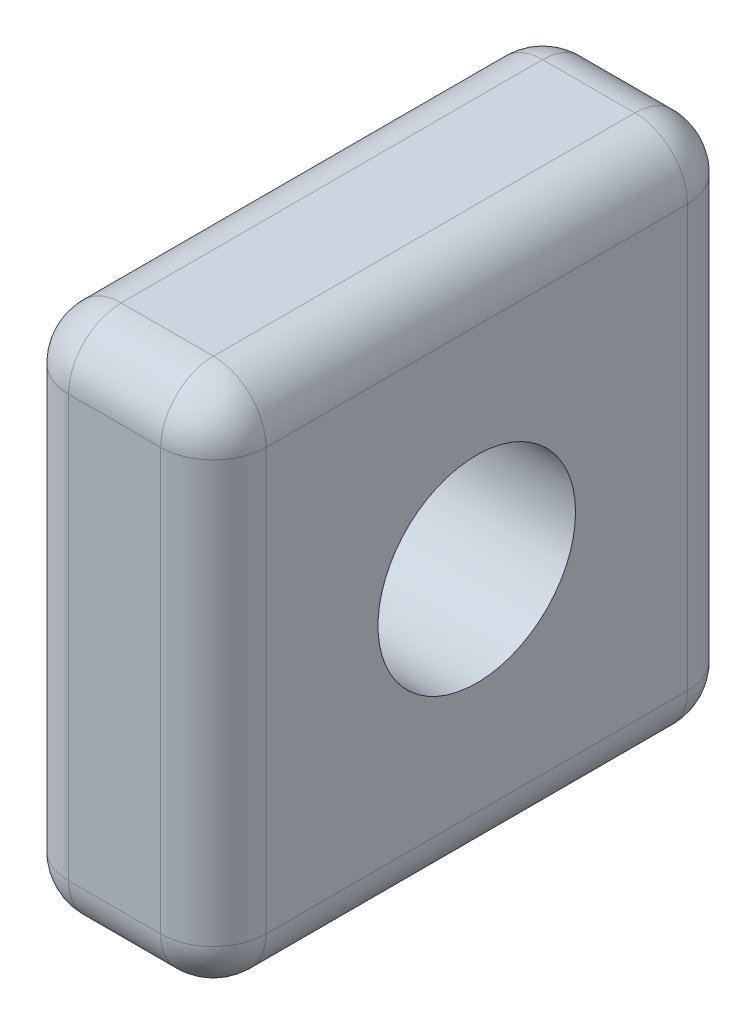
ISO-10303-21;
HEADER;
FILE_DESCRIPTION(('STEP AP214'),'2;1');
FILE_NAME('part.step','',(''),(''),'','','');
FILE_SCHEMA(('AUTOMOTIVE_DESIGN { 1 0 10303 214 1 1 1 1 }'));
ENDSEC;
DATA;
#1=APPLICATION_CONTEXT('core data for automotive mechanical design processes');
#2=APPLICATION_PROTOCOL_DEFINITION('international standard','automotive_design',2000,#1);
#3=PRODUCT_CONTEXT('',#1,'mechanical');
#4=PRODUCT('Part','Part','',(#3));
#5=PRODUCT_RELATED_PRODUCT_CATEGORY('part','',(#4));
#6=PRODUCT_DEFINITION_FORMATION('','',#4);
#7=PRODUCT_DEFINITION_CONTEXT('part definition',#1,'design');
#8=PRODUCT_DEFINITION('design','',#6,#7);
#9=PRODUCT_DEFINITION_SHAPE('','',#8);
#10=(LENGTH_UNIT() NAMED_UNIT(*) SI_UNIT(.MILLI.,.METRE.));
#11=(NAMED_UNIT(*) PLANE_ANGLE_UNIT() SI_UNIT($,.RADIAN.));
#12=(NAMED_UNIT(*) SI_UNIT($,.STERADIAN.) SOLID_ANGLE_UNIT());
#13=UNCERTAINTY_MEASURE_WITH_UNIT(LENGTH_MEASURE(1.E-05),#10,'distance_accuracy_value','');
#14=(GEOMETRIC_REPRESENTATION_CONTEXT(3) GLOBAL_UNCERTAINTY_ASSIGNED_CONTEXT((#13)) GLOBAL_UNIT_ASSIGNED_CONTEXT((#10,
#11,#12)) REPRESENTATION_CONTEXT('',''));
#15=CARTESIAN_POINT('',(0.,0.,0.));
#16=DIRECTION('',(0.,0.,1.));
#17=DIRECTION('',(1.,0.,0.));
#18=AXIS2_PLACEMENT_3D('',#15,#16,#17);
#19=CARTESIAN_POINT('',(4.7625,0.,0.));
#20=DIRECTION('',(0.,0.,-1.));
#21=DIRECTION('',(-1.,0.,0.));
#22=AXIS2_PLACEMENT_3D('',#19,#20,#21);
#23=PLANE('',#22);
#24=DIRECTION('',(0.,-1.,0.));
#25=VECTOR('',#24,1.);
#26=CARTESIAN_POINT('',(1.27,0.,0.));
#27=LINE('',#26,#25);
#28=CARTESIAN_POINT('',(1.27,11.43,0.));
#29=VERTEX_POINT('',#28);
#30=CARTESIAN_POINT('',(1.27,1.27,0.));
#31=VERTEX_POINT('',#30);
#32=EDGE_CURVE('E211',#29,#31,#27,.T.);
#33=ORIENTED_EDGE('',*,*,#32,.T.);
#34=DIRECTION('',(-1.,0.,0.));
#35=VECTOR('',#34,1.);
#36=CARTESIAN_POINT('',(4.7625,1.27,0.));
#37=LINE('',#36,#35);
#38=CARTESIAN_POINT('',(3.4925,1.27,0.));
#39=VERTEX_POINT('',#38);
#40=EDGE_CURVE('E214',#31,#39,#37,.F.);
#41=ORIENTED_EDGE('',*,*,#40,.T.);
#42=DIRECTION('',(0.,-1.,0.));
#43=VECTOR('',#42,1.);
#44=CARTESIAN_POINT('',(3.4925,0.,0.));
#45=LINE('',#44,#43);
#46=CARTESIAN_POINT('',(3.4925,11.43,0.));
#47=VERTEX_POINT('',#46);
#48=EDGE_CURVE('E321',#39,#47,#45,.F.);
#49=ORIENTED_EDGE('',*,*,#48,.T.);
#50=DIRECTION('',(-1.,0.,0.));
#51=VECTOR('',#50,1.);
#52=CARTESIAN_POINT('',(4.7625,11.43,0.));
#53=LINE('',#52,#51);
#54=EDGE_CURVE('E208',#47,#29,#53,.T.);
#55=ORIENTED_EDGE('',*,*,#54,.T.);
#56=EDGE_LOOP('',(#33,#41,#49,#55));
#57=FACE_BOUND('',#56,.T.);
#58=ADVANCED_FACE('F46',(#57),#23,.F.);
#59=CARTESIAN_POINT('',(4.7625,0.,0.));
#60=DIRECTION('',(0.,1.,0.));
#61=DIRECTION('',(0.,0.,1.));
#62=AXIS2_PLACEMENT_3D('',#59,#60,#61);
#63=PLANE('',#62);
#64=DIRECTION('',(0.,0.,-1.));
#65=VECTOR('',#64,1.);
#66=CARTESIAN_POINT('',(3.4925,0.,0.));
#67=LINE('',#66,#65);
#68=CARTESIAN_POINT('',(3.4925,0.,-11.43));
#69=VERTEX_POINT('',#68);
#70=CARTESIAN_POINT('',(3.4925,0.,-1.27));
#71=VERTEX_POINT('',#70);
#72=EDGE_CURVE('E317',#69,#71,#67,.F.);
#73=ORIENTED_EDGE('',*,*,#72,.T.);
#74=DIRECTION('',(-1.,0.,0.));
#75=VECTOR('',#74,1.);
#76=CARTESIAN_POINT('',(4.7625,0.,-1.27));
#77=LINE('',#76,#75);
#78=CARTESIAN_POINT('',(1.27,0.,-1.27));
#79=VERTEX_POINT('',#78);
#80=EDGE_CURVE('E223',#71,#79,#77,.T.);
#81=ORIENTED_EDGE('',*,*,#80,.T.);
#82=DIRECTION('',(0.,0.,-1.));
#83=VECTOR('',#82,1.);
#84=CARTESIAN_POINT('',(1.27,0.,-12.7));
#85=LINE('',#84,#83);
#86=CARTESIAN_POINT('',(1.27,0.,-11.43));
#87=VERTEX_POINT('',#86);
#88=EDGE_CURVE('E220',#79,#87,#85,.T.);
#89=ORIENTED_EDGE('',*,*,#88,.T.);
#90=DIRECTION('',(-1.,0.,0.));
#91=VECTOR('',#90,1.);
#92=CARTESIAN_POINT('',(4.7625,0.,-11.43));
#93=LINE('',#92,#91);
#94=EDGE_CURVE('E217',#87,#69,#93,.F.);
#95=ORIENTED_EDGE('',*,*,#94,.T.);
#96=EDGE_LOOP('',(#73,#81,#89,#95));
#97=FACE_BOUND('',#96,.T.);
#98=ADVANCED_FACE('F400',(#97),#63,.F.);
#99=CARTESIAN_POINT('',(4.7625,0.,-12.7));
#100=DIRECTION('',(0.,0.,1.));
#101=DIRECTION('',(1.,0.,0.));
#102=AXIS2_PLACEMENT_3D('',#99,#100,#101);
#103=PLANE('',#102);
#104=DIRECTION('',(0.,1.,0.));
#105=VECTOR('',#104,1.);
#106=CARTESIAN_POINT('',(3.4925,0.,-12.7));
#107=LINE('',#106,#105);
#108=CARTESIAN_POINT('',(3.4925,11.43,-12.7));
#109=VERTEX_POINT('',#108);
#110=CARTESIAN_POINT('',(3.4925,1.27,-12.7));
#111=VERTEX_POINT('',#110);
#112=EDGE_CURVE('E141',#109,#111,#107,.F.);
#113=ORIENTED_EDGE('',*,*,#112,.T.);
#114=DIRECTION('',(-1.,0.,0.));
#115=VECTOR('',#114,1.);
#116=CARTESIAN_POINT('',(4.7625,1.27,-12.7));
#117=LINE('',#116,#115);
#118=CARTESIAN_POINT('',(1.27,1.27,-12.7));
#119=VERTEX_POINT('',#118);
#120=EDGE_CURVE('E11',#111,#119,#117,.T.);
#121=ORIENTED_EDGE('',*,*,#120,.T.);
#122=DIRECTION('',(0.,1.,0.));
#123=VECTOR('',#122,1.);
#124=CARTESIAN_POINT('',(1.27,12.7,-12.7));
#125=LINE('',#124,#123);
#126=CARTESIAN_POINT('',(1.27,11.43,-12.7));
#127=VERTEX_POINT('',#126);
#128=EDGE_CURVE('E56',#119,#127,#125,.T.);
#129=ORIENTED_EDGE('',*,*,#128,.T.);
#130=DIRECTION('',(-1.,0.,0.));
#131=VECTOR('',#130,1.);
#132=CARTESIAN_POINT('',(4.7625,11.43,-12.7));
#133=LINE('',#132,#131);
#134=EDGE_CURVE('E235',#127,#109,#133,.F.);
#135=ORIENTED_EDGE('',*,*,#134,.T.);
#136=EDGE_LOOP('',(#113,#121,#129,#135));
#137=FACE_BOUND('',#136,.T.);
#138=ADVANCED_FACE('F398',(#137),#103,.F.);
#139=CARTESIAN_POINT('',(4.7625,12.7,0.));
#140=DIRECTION('',(0.,-1.,0.));
#141=DIRECTION('',(0.,0.,-1.));
#142=AXIS2_PLACEMENT_3D('',#139,#140,#141);
#143=PLANE('',#142);
#144=DIRECTION('',(0.,0.,1.));
#145=VECTOR('',#144,1.);
#146=CARTESIAN_POINT('',(1.27,12.7,0.));
#147=LINE('',#146,#145);
#148=CARTESIAN_POINT('',(1.27,12.7,-11.43));
#149=VERTEX_POINT('',#148);
#150=CARTESIAN_POINT('',(1.27,12.7,-1.27));
#151=VERTEX_POINT('',#150);
#152=EDGE_CURVE('E229',#149,#151,#147,.T.);
#153=ORIENTED_EDGE('',*,*,#152,.T.);
#154=DIRECTION('',(-1.,0.,0.));
#155=VECTOR('',#154,1.);
#156=CARTESIAN_POINT('',(4.7625,12.7,-1.27));
#157=LINE('',#156,#155);
#158=CARTESIAN_POINT('',(3.4925,12.7,-1.27));
#159=VERTEX_POINT('',#158);
#160=EDGE_CURVE('E232',#151,#159,#157,.F.);
#161=ORIENTED_EDGE('',*,*,#160,.T.);
#162=DIRECTION('',(0.,0.,1.));
#163=VECTOR('',#162,1.);
#164=CARTESIAN_POINT('',(3.4925,12.7,0.));
#165=LINE('',#164,#163);
#166=CARTESIAN_POINT('',(3.4925,12.7,-11.43));
#167=VERTEX_POINT('',#166);
#168=EDGE_CURVE('E325',#159,#167,#165,.F.);
#169=ORIENTED_EDGE('',*,*,#168,.T.);
#170=DIRECTION('',(-1.,0.,0.));
#171=VECTOR('',#170,1.);
#172=CARTESIAN_POINT('',(4.7625,12.7,-11.43));
#173=LINE('',#172,#171);
#174=EDGE_CURVE('E226',#167,#149,#173,.T.);
#175=ORIENTED_EDGE('',*,*,#174,.T.);
#176=EDGE_LOOP('',(#153,#161,#169,#175));
#177=FACE_BOUND('',#176,.T.);
#178=ADVANCED_FACE('F396',(#177),#143,.F.);
#179=CARTESIAN_POINT('',(4.7625,0.,0.));
#180=DIRECTION('',(-1.,0.,0.));
#181=DIRECTION('',(0.,0.,1.));
#182=AXIS2_PLACEMENT_3D('',#179,#180,#181);
#183=PLANE('',#182);
#184=DIRECTION('',(0.,0.,-1.));
#185=VECTOR('',#184,1.);
#186=CARTESIAN_POINT('',(4.7625,1.27,0.));
#187=LINE('',#186,#185);
#188=CARTESIAN_POINT('',(4.7625,1.27,-1.27));
#189=VERTEX_POINT('',#188);
#190=CARTESIAN_POINT('',(4.7625,1.27,-11.43));
#191=VERTEX_POINT('',#190);
#192=EDGE_CURVE('E169',#189,#191,#187,.T.);
#193=ORIENTED_EDGE('',*,*,#192,.T.);
#194=DIRECTION('',(0.,1.,0.));
#195=VECTOR('',#194,1.);
#196=CARTESIAN_POINT('',(4.7625,0.,-11.43));
#197=LINE('',#196,#195);
#198=CARTESIAN_POINT('',(4.7625,11.43,-11.43));
#199=VERTEX_POINT('',#198);
#200=EDGE_CURVE('E139',#191,#199,#197,.T.);
#201=ORIENTED_EDGE('',*,*,#200,.T.);
#202=DIRECTION('',(0.,0.,1.));
#203=VECTOR('',#202,1.);
#204=CARTESIAN_POINT('',(4.7625,11.43,0.));
#205=LINE('',#204,#203);
#206=CARTESIAN_POINT('',(4.7625,11.43,-1.27));
#207=VERTEX_POINT('',#206);
#208=EDGE_CURVE('E152',#199,#207,#205,.T.);
#209=ORIENTED_EDGE('',*,*,#208,.T.);
#210=DIRECTION('',(0.,-1.,0.));
#211=VECTOR('',#210,1.);
#212=CARTESIAN_POINT('',(4.7625,0.,-1.27));
#213=LINE('',#212,#211);
#214=EDGE_CURVE('E162',#207,#189,#213,.T.);
#215=ORIENTED_EDGE('',*,*,#214,.T.);
#216=EDGE_LOOP('',(#193,#201,#209,#215));
#217=FACE_BOUND('',#216,.T.);
#218=CARTESIAN_POINT('',(4.7625,6.35,-6.35));
#219=DIRECTION('',(1.,0.,0.));
#220=DIRECTION('',(0.,0.,-1.));
#221=AXIS2_PLACEMENT_3D('',#218,#219,#220);
#222=CIRCLE('',#221,2.38125);
#223=CARTESIAN_POINT('',(4.7625,6.35,-8.73125));
#224=VERTEX_POINT('',#223);
#225=EDGE_CURVE('E163',#224,#224,#222,.T.);
#226=ORIENTED_EDGE('',*,*,#225,.F.);
#227=EDGE_LOOP('',(#226));
#228=FACE_BOUND('',#227,.T.);
#229=ADVANCED_FACE('F166',(#217,#228),#183,.F.);
#230=CARTESIAN_POINT('',(0.,0.,0.));
#231=DIRECTION('',(-1.,0.,0.));
#232=DIRECTION('',(0.,0.,1.));
#233=AXIS2_PLACEMENT_3D('',#230,#231,#232);
#234=PLANE('',#233);
#235=CARTESIAN_POINT('',(0.,6.35,-6.35));
#236=DIRECTION('',(-1.,0.,0.));
#237=DIRECTION('',(0.,0.,1.));
#238=AXIS2_PLACEMENT_3D('',#235,#236,#237);
#239=CIRCLE('',#238,3.65125);
#240=CARTESIAN_POINT('',(0.,6.35,-2.69875));
#241=VERTEX_POINT('',#240);
#242=EDGE_CURVE('E200',#241,#241,#239,.F.);
#243=ORIENTED_EDGE('',*,*,#242,.T.);
#244=EDGE_LOOP('',(#243));
#245=FACE_BOUND('',#244,.T.);
#246=DIRECTION('',(0.,0.,-1.));
#247=VECTOR('',#246,1.);
#248=CARTESIAN_POINT('',(0.,1.27,0.));
#249=LINE('',#248,#247);
#250=CARTESIAN_POINT('',(0.,1.27,-11.43));
#251=VERTEX_POINT('',#250);
#252=CARTESIAN_POINT('',(0.,1.27,-1.27));
#253=VERTEX_POINT('',#252);
#254=EDGE_CURVE('E193',#251,#253,#249,.F.);
#255=ORIENTED_EDGE('',*,*,#254,.T.);
#256=DIRECTION('',(0.,-1.,0.));
#257=VECTOR('',#256,1.);
#258=CARTESIAN_POINT('',(0.,12.7,-1.27));
#259=LINE('',#258,#257);
#260=CARTESIAN_POINT('',(0.,11.43,-1.27));
#261=VERTEX_POINT('',#260);
#262=EDGE_CURVE('E196',#253,#261,#259,.F.);
#263=ORIENTED_EDGE('',*,*,#262,.T.);
#264=DIRECTION('',(0.,0.,1.));
#265=VECTOR('',#264,1.);
#266=CARTESIAN_POINT('',(0.,11.43,-12.7));
#267=LINE('',#266,#265);
#268=CARTESIAN_POINT('',(0.,11.43,-11.43));
#269=VERTEX_POINT('',#268);
#270=EDGE_CURVE('E190',#261,#269,#267,.F.);
#271=ORIENTED_EDGE('',*,*,#270,.T.);
#272=DIRECTION('',(0.,1.,0.));
#273=VECTOR('',#272,1.);
#274=CARTESIAN_POINT('',(0.,0.,-11.43));
#275=LINE('',#274,#273);
#276=EDGE_CURVE('E187',#269,#251,#275,.F.);
#277=ORIENTED_EDGE('',*,*,#276,.T.);
#278=EDGE_LOOP('',(#255,#263,#271,#277));
#279=FACE_BOUND('',#278,.T.);
#280=ADVANCED_FACE('F633',(#245,#279),#234,.T.);
#281=CARTESIAN_POINT('',(0.,6.35,-6.35));
#282=DIRECTION('',(1.,0.,0.));
#283=DIRECTION('',(0.,0.,-1.));
#284=AXIS2_PLACEMENT_3D('',#281,#282,#283);
#285=CYLINDRICAL_SURFACE('',#284,2.38125);
#286=CARTESIAN_POINT('',(1.27,6.35,-6.35));
#287=DIRECTION('',(-1.,0.,0.));
#288=DIRECTION('',(0.,0.,1.));
#289=AXIS2_PLACEMENT_3D('',#286,#287,#288);
#290=CIRCLE('',#289,2.38125);
#291=CARTESIAN_POINT('',(1.27,6.35,-8.73125));
#292=VERTEX_POINT('',#291);
#293=EDGE_CURVE('E204',#292,#292,#290,.T.);
#294=CARTESIAN_POINT('',(1.27,6.35,-8.73125));
#295=CARTESIAN_POINT('',(1.30638020833333,6.35,-8.73125));
#296=CARTESIAN_POINT('',(1.34276041666667,6.35,-8.73125));
#297=CARTESIAN_POINT('',(1.41552083333333,6.35,-8.73125));
#298=CARTESIAN_POINT('',(1.45190104166667,6.35,-8.73125));
#299=CARTESIAN_POINT('',(1.52466145833333,6.35,-8.73125));
#300=CARTESIAN_POINT('',(1.56104166666667,6.35,-8.73125));
#301=CARTESIAN_POINT('',(1.63380208333333,6.35,-8.73125));
#302=CARTESIAN_POINT('',(1.67018229166667,6.35,-8.73125));
#303=CARTESIAN_POINT('',(1.74294270833333,6.35,-8.73125));
#304=CARTESIAN_POINT('',(1.77932291666667,6.35,-8.73125));
#305=CARTESIAN_POINT('',(1.85208333333333,6.35,-8.73125));
#306=CARTESIAN_POINT('',(1.88846354166667,6.35,-8.73125));
#307=CARTESIAN_POINT('',(1.96122395833333,6.35,-8.73125));
#308=CARTESIAN_POINT('',(1.99760416666667,6.35,-8.73125));
#309=CARTESIAN_POINT('',(2.07036458333333,6.35,-8.73125));
#310=CARTESIAN_POINT('',(2.10674479166667,6.35,-8.73125));
#311=CARTESIAN_POINT('',(2.17950520833333,6.35,-8.73125));
#312=CARTESIAN_POINT('',(2.21588541666667,6.35,-8.73125));
#313=CARTESIAN_POINT('',(2.28864583333333,6.35,-8.73125));
#314=CARTESIAN_POINT('',(2.32502604166667,6.35,-8.73125));
#315=CARTESIAN_POINT('',(2.39778645833333,6.35,-8.73125));
#316=CARTESIAN_POINT('',(2.43416666666667,6.35,-8.73125));
#317=CARTESIAN_POINT('',(2.50692708333333,6.35,-8.73125));
#318=CARTESIAN_POINT('',(2.54330729166667,6.35,-8.73125));
#319=CARTESIAN_POINT('',(2.61606770833333,6.35,-8.73125));
#320=CARTESIAN_POINT('',(2.65244791666667,6.35,-8.73125));
#321=CARTESIAN_POINT('',(2.72520833333333,6.35,-8.73125));
#322=CARTESIAN_POINT('',(2.76158854166667,6.35,-8.73125));
#323=CARTESIAN_POINT('',(2.83434895833333,6.35,-8.73125));
#324=CARTESIAN_POINT('',(2.87072916666667,6.35,-8.73125));
#325=CARTESIAN_POINT('',(2.94348958333333,6.35,-8.73125));
#326=CARTESIAN_POINT('',(2.97986979166667,6.35,-8.73125));
#327=CARTESIAN_POINT('',(3.05263020833333,6.35,-8.73125));
#328=CARTESIAN_POINT('',(3.08901041666667,6.35,-8.73125));
#329=CARTESIAN_POINT('',(3.16177083333333,6.35,-8.73125));
#330=CARTESIAN_POINT('',(3.19815104166667,6.35,-8.73125));
#331=CARTESIAN_POINT('',(3.27091145833333,6.35,-8.73125));
#332=CARTESIAN_POINT('',(3.30729166666667,6.35,-8.73125));
#333=CARTESIAN_POINT('',(3.38005208333333,6.35,-8.73125));
#334=CARTESIAN_POINT('',(3.41643229166667,6.35,-8.73125));
#335=CARTESIAN_POINT('',(3.48919270833333,6.35,-8.73125));
#336=CARTESIAN_POINT('',(3.52557291666667,6.35,-8.73125));
#337=CARTESIAN_POINT('',(3.59833333333333,6.35,-8.73125));
#338=CARTESIAN_POINT('',(3.63471354166667,6.35,-8.73125));
#339=CARTESIAN_POINT('',(3.70747395833333,6.35,-8.73125));
#340=CARTESIAN_POINT('',(3.74385416666667,6.35,-8.73125));
#341=CARTESIAN_POINT('',(3.81661458333333,6.35,-8.73125));
#342=CARTESIAN_POINT('',(3.85299479166667,6.35,-8.73125));
#343=CARTESIAN_POINT('',(3.92575520833333,6.35,-8.73125));
#344=CARTESIAN_POINT('',(3.96213541666667,6.35,-8.73125));
#345=CARTESIAN_POINT('',(4.03489583333333,6.35,-8.73125));
#346=CARTESIAN_POINT('',(4.07127604166667,6.35,-8.73125));
#347=CARTESIAN_POINT('',(4.14403645833333,6.35,-8.73125));
#348=CARTESIAN_POINT('',(4.18041666666667,6.35,-8.73125));
#349=CARTESIAN_POINT('',(4.25317708333333,6.35,-8.73125));
#350=CARTESIAN_POINT('',(4.28955729166667,6.35,-8.73125));
#351=CARTESIAN_POINT('',(4.36231770833333,6.35,-8.73125));
#352=CARTESIAN_POINT('',(4.39869791666667,6.35,-8.73125));
#353=CARTESIAN_POINT('',(4.47145833333333,6.35,-8.73125));
#354=CARTESIAN_POINT('',(4.50783854166667,6.35,-8.73125));
#355=CARTESIAN_POINT('',(4.58059895833333,6.35,-8.73125));
#356=CARTESIAN_POINT('',(4.61697916666667,6.35,-8.73125));
#357=CARTESIAN_POINT('',(4.68973958333333,6.35,-8.73125));
#358=CARTESIAN_POINT('',(4.72611979166667,6.35,-8.73125));
#359=CARTESIAN_POINT('',(4.7625,6.35,-8.73125));
#360=B_SPLINE_CURVE_WITH_KNOTS('',3,(#294,#295,#296,#297,#298,#299,#300,#301,#302,#303,#304,
#305,#306,#307,#308,#309,#310,#311,#312,#313,#314,#315,#316,#317,#318,#319,#320,#321,#322,#323,
#324,#325,#326,#327,#328,#329,#330,#331,#332,#333,#334,#335,#336,#337,#338,#339,#340,#341,#342,
#343,#344,#345,#346,#347,#348,#349,#350,#351,#352,#353,#354,#355,#356,#357,#358,#359),
.UNSPECIFIED.,.F.,.F.,(4,2,2,2,2,2,2,2,2,2,2,2,2,2,2,2,2,2,2,2,2,2,2,2,2,2,2,2,2,2,2,2,4),(0.,
0.109140625,0.21828125,0.327421875,0.4365625,0.545703125,0.65484375,0.763984375,0.873125,
0.982265625,1.09140625,1.200546875,1.3096875,1.418828125,1.52796875,1.637109375,1.74625,
1.855390625,1.96453125,2.073671875,2.1828125,2.291953125,2.40109375,2.510234375,2.619375,
2.728515625,2.83765625,2.946796875,3.0559375,3.165078125,3.27421875,3.383359375,3.4925),.UNSPECIFIED.);
#361=EDGE_CURVE('BSEAM422',#292,#224,#360,.T.);
#362=ORIENTED_EDGE('',*,*,#293,.T.);
#363=ORIENTED_EDGE('',*,*,#225,.T.);
#364=ORIENTED_EDGE('',*,*,#361,.T.);
#365=ORIENTED_EDGE('',*,*,#361,.F.);
#366=EDGE_LOOP('',(#362,#364,#363,#365));
#367=FACE_BOUND('',#366,.T.);
#368=ADVANCED_FACE('F422',(#367),#285,.F.);
#369=CARTESIAN_POINT('',(3.4925,0.,-1.27));
#370=DIRECTION('',(0.,-1.,0.));
#371=DIRECTION('',(0.,0.,-1.));
#372=AXIS2_PLACEMENT_3D('',#369,#370,#371);
#373=CYLINDRICAL_SURFACE('',#372,1.27);
#374=ORIENTED_EDGE('',*,*,#48,.F.);
#375=CARTESIAN_POINT('',(3.4925,1.27,-1.27));
#376=DIRECTION('',(0.,-1.,0.));
#377=DIRECTION('',(0.,0.,-1.));
#378=AXIS2_PLACEMENT_3D('',#375,#376,#377);
#379=CIRCLE('',#378,1.27);
#380=EDGE_CURVE('E175',#39,#189,#379,.F.);
#381=ORIENTED_EDGE('',*,*,#380,.T.);
#382=ORIENTED_EDGE('',*,*,#214,.F.);
#383=CARTESIAN_POINT('',(3.4925,11.43,-1.27));
#384=DIRECTION('',(0.,-1.,0.));
#385=DIRECTION('',(0.,0.,-1.));
#386=AXIS2_PLACEMENT_3D('',#383,#384,#385);
#387=CIRCLE('',#386,1.27);
#388=EDGE_CURVE('E181',#207,#47,#387,.T.);
#389=ORIENTED_EDGE('',*,*,#388,.T.);
#390=EDGE_LOOP('',(#374,#381,#382,#389));
#391=FACE_BOUND('',#390,.T.);
#392=ADVANCED_FACE('F339',(#391),#373,.T.);
#393=CARTESIAN_POINT('',(3.4925,1.27,0.));
#394=DIRECTION('',(0.,0.,-1.));
#395=DIRECTION('',(-1.,0.,0.));
#396=AXIS2_PLACEMENT_3D('',#393,#394,#395);
#397=CYLINDRICAL_SURFACE('',#396,1.27);
#398=ORIENTED_EDGE('',*,*,#192,.F.);
#399=CARTESIAN_POINT('',(3.4925,1.27,-1.27));
#400=DIRECTION('',(0.,0.,-1.));
#401=DIRECTION('',(-1.,0.,0.));
#402=AXIS2_PLACEMENT_3D('',#399,#400,#401);
#403=CIRCLE('',#402,1.27);
#404=EDGE_CURVE('E331',#189,#71,#403,.T.);
#405=ORIENTED_EDGE('',*,*,#404,.T.);
#406=ORIENTED_EDGE('',*,*,#72,.F.);
#407=CARTESIAN_POINT('',(3.4925,1.27,-11.43));
#408=DIRECTION('',(0.,0.,-1.));
#409=DIRECTION('',(-1.,0.,0.));
#410=AXIS2_PLACEMENT_3D('',#407,#408,#409);
#411=CIRCLE('',#410,1.27);
#412=EDGE_CURVE('E328',#69,#191,#411,.F.);
#413=ORIENTED_EDGE('',*,*,#412,.T.);
#414=EDGE_LOOP('',(#398,#405,#406,#413));
#415=FACE_BOUND('',#414,.T.);
#416=ADVANCED_FACE('F373',(#415),#397,.T.);
#417=CARTESIAN_POINT('',(3.4925,11.43,0.));
#418=DIRECTION('',(0.,0.,1.));
#419=DIRECTION('',(1.,0.,0.));
#420=AXIS2_PLACEMENT_3D('',#417,#418,#419);
#421=CYLINDRICAL_SURFACE('',#420,1.27);
#422=ORIENTED_EDGE('',*,*,#168,.F.);
#423=CARTESIAN_POINT('',(3.4925,11.43,-1.27));
#424=DIRECTION('',(0.,0.,1.));
#425=DIRECTION('',(1.,0.,0.));
#426=AXIS2_PLACEMENT_3D('',#423,#424,#425);
#427=CIRCLE('',#426,1.27);
#428=EDGE_CURVE('E148',#159,#207,#427,.F.);
#429=ORIENTED_EDGE('',*,*,#428,.T.);
#430=ORIENTED_EDGE('',*,*,#208,.F.);
#431=CARTESIAN_POINT('',(3.4925,11.43,-11.43));
#432=DIRECTION('',(0.,0.,1.));
#433=DIRECTION('',(1.,0.,0.));
#434=AXIS2_PLACEMENT_3D('',#431,#432,#433);
#435=CIRCLE('',#434,1.27);
#436=EDGE_CURVE('E155',#199,#167,#435,.T.);
#437=ORIENTED_EDGE('',*,*,#436,.T.);
#438=EDGE_LOOP('',(#422,#429,#430,#437));
#439=FACE_BOUND('',#438,.T.);
#440=ADVANCED_FACE('F154',(#439),#421,.T.);
#441=CARTESIAN_POINT('',(3.4925,0.,-11.43));
#442=DIRECTION('',(0.,1.,0.));
#443=DIRECTION('',(0.,0.,1.));
#444=AXIS2_PLACEMENT_3D('',#441,#442,#443);
#445=CYLINDRICAL_SURFACE('',#444,1.27);
#446=ORIENTED_EDGE('',*,*,#200,.F.);
#447=CARTESIAN_POINT('',(3.4925,1.27,-11.43));
#448=DIRECTION('',(0.,1.,0.));
#449=DIRECTION('',(0.,0.,1.));
#450=AXIS2_PLACEMENT_3D('',#447,#448,#449);
#451=CIRCLE('',#450,1.27);
#452=EDGE_CURVE('E147',#191,#111,#451,.T.);
#453=ORIENTED_EDGE('',*,*,#452,.T.);
#454=ORIENTED_EDGE('',*,*,#112,.F.);
#455=CARTESIAN_POINT('',(3.4925,11.43,-11.43));
#456=DIRECTION('',(0.,1.,0.));
#457=DIRECTION('',(0.,0.,1.));
#458=AXIS2_PLACEMENT_3D('',#455,#456,#457);
#459=CIRCLE('',#458,1.27);
#460=EDGE_CURVE('E135',#109,#199,#459,.F.);
#461=ORIENTED_EDGE('',*,*,#460,.T.);
#462=EDGE_LOOP('',(#446,#453,#454,#461));
#463=FACE_BOUND('',#462,.T.);
#464=ADVANCED_FACE('F137',(#463),#445,.T.);
#465=CARTESIAN_POINT('',(3.4925,11.43,-11.43));
#466=DIRECTION('',(0.,0.,1.));
#467=DIRECTION('',(1.,0.,0.));
#468=AXIS2_PLACEMENT_3D('',#465,#466,#467);
#469=SPHERICAL_SURFACE('',#468,1.27);
#470=ORIENTED_EDGE('',*,*,#436,.F.);
#471=ORIENTED_EDGE('',*,*,#460,.F.);
#472=CARTESIAN_POINT('',(3.4925,11.43,-11.43));
#473=DIRECTION('',(-1.,0.,0.));
#474=DIRECTION('',(0.,0.,1.));
#475=AXIS2_PLACEMENT_3D('',#472,#473,#474);
#476=CIRCLE('',#475,1.27);
#477=EDGE_CURVE('E50',#167,#109,#476,.T.);
#478=ORIENTED_EDGE('',*,*,#477,.F.);
#479=EDGE_LOOP('',(#470,#471,#478));
#480=FACE_BOUND('',#479,.T.);
#481=ADVANCED_FACE('F172',(#480),#469,.T.);
#482=CARTESIAN_POINT('',(4.7625,11.43,-11.43));
#483=DIRECTION('',(-1.,0.,0.));
#484=DIRECTION('',(0.,0.,1.));
#485=AXIS2_PLACEMENT_3D('',#482,#483,#484);
#486=CYLINDRICAL_SURFACE('',#485,1.27);
#487=ORIENTED_EDGE('',*,*,#477,.T.);
#488=ORIENTED_EDGE('',*,*,#134,.F.);
#489=CARTESIAN_POINT('',(1.27,11.43,-11.43));
#490=DIRECTION('',(-1.,0.,0.));
#491=DIRECTION('',(0.,0.,1.));
#492=AXIS2_PLACEMENT_3D('',#489,#490,#491);
#493=CIRCLE('',#492,1.27);
#494=EDGE_CURVE('E293',#149,#127,#493,.T.);
#495=ORIENTED_EDGE('',*,*,#494,.F.);
#496=ORIENTED_EDGE('',*,*,#174,.F.);
#497=EDGE_LOOP('',(#487,#488,#495,#496));
#498=FACE_BOUND('',#497,.T.);
#499=ADVANCED_FACE('F397',(#498),#486,.T.);
#500=CARTESIAN_POINT('',(3.4925,1.27,-11.43));
#501=DIRECTION('',(0.,0.,1.));
#502=DIRECTION('',(1.,0.,0.));
#503=AXIS2_PLACEMENT_3D('',#500,#501,#502);
#504=SPHERICAL_SURFACE('',#503,1.27);
#505=ORIENTED_EDGE('',*,*,#452,.F.);
#506=ORIENTED_EDGE('',*,*,#412,.F.);
#507=CARTESIAN_POINT('',(3.4925,1.27,-11.43));
#508=DIRECTION('',(-1.,0.,0.));
#509=DIRECTION('',(0.,0.,1.));
#510=AXIS2_PLACEMENT_3D('',#507,#508,#509);
#511=CIRCLE('',#510,1.27);
#512=EDGE_CURVE('E290',#111,#69,#511,.T.);
#513=ORIENTED_EDGE('',*,*,#512,.F.);
#514=EDGE_LOOP('',(#505,#506,#513));
#515=FACE_BOUND('',#514,.T.);
#516=ADVANCED_FACE('F378',(#515),#504,.T.);
#517=CARTESIAN_POINT('',(1.27,11.43,-11.43));
#518=DIRECTION('',(0.,0.,-1.));
#519=DIRECTION('',(-1.,0.,0.));
#520=AXIS2_PLACEMENT_3D('',#517,#518,#519);
#521=SPHERICAL_SURFACE('',#520,1.27);
#522=CARTESIAN_POINT('',(1.27,11.43,-11.43));
#523=DIRECTION('',(0.,0.,-1.));
#524=DIRECTION('',(0.,1.,0.));
#525=AXIS2_PLACEMENT_3D('',#522,#523,#524);
#526=CIRCLE('',#525,1.27);
#527=EDGE_CURVE('E282',#149,#269,#526,.F.);
#528=ORIENTED_EDGE('',*,*,#527,.F.);
#529=ORIENTED_EDGE('',*,*,#494,.T.);
#530=CARTESIAN_POINT('',(1.27,11.43,-11.43));
#531=DIRECTION('',(0.,1.,0.));
#532=DIRECTION('',(0.,0.,1.));
#533=AXIS2_PLACEMENT_3D('',#530,#531,#532);
#534=CIRCLE('',#533,1.27);
#535=EDGE_CURVE('E286',#269,#127,#534,.F.);
#536=ORIENTED_EDGE('',*,*,#535,.F.);
#537=EDGE_LOOP('',(#528,#529,#536));
#538=FACE_BOUND('',#537,.T.);
#539=ADVANCED_FACE('F391',(#538),#521,.T.);
#540=CARTESIAN_POINT('',(3.4925,11.43,-1.27));
#541=DIRECTION('',(0.,0.,1.));
#542=DIRECTION('',(1.,0.,0.));
#543=AXIS2_PLACEMENT_3D('',#540,#541,#542);
#544=SPHERICAL_SURFACE('',#543,1.27);
#545=ORIENTED_EDGE('',*,*,#388,.F.);
#546=ORIENTED_EDGE('',*,*,#428,.F.);
#547=CARTESIAN_POINT('',(3.4925,11.43,-1.27));
#548=DIRECTION('',(-1.,0.,0.));
#549=DIRECTION('',(0.,0.,1.));
#550=AXIS2_PLACEMENT_3D('',#547,#548,#549);
#551=CIRCLE('',#550,1.27);
#552=EDGE_CURVE('E278',#47,#159,#551,.T.);
#553=ORIENTED_EDGE('',*,*,#552,.F.);
#554=EDGE_LOOP('',(#545,#546,#553));
#555=FACE_BOUND('',#554,.T.);
#556=ADVANCED_FACE('F347',(#555),#544,.T.);
#557=CARTESIAN_POINT('',(4.7625,1.27,-11.43));
#558=DIRECTION('',(-1.,0.,0.));
#559=DIRECTION('',(0.,0.,1.));
#560=AXIS2_PLACEMENT_3D('',#557,#558,#559);
#561=CYLINDRICAL_SURFACE('',#560,1.27);
#562=ORIENTED_EDGE('',*,*,#512,.T.);
#563=ORIENTED_EDGE('',*,*,#94,.F.);
#564=CARTESIAN_POINT('',(1.27,1.27,-11.43));
#565=DIRECTION('',(-1.,0.,0.));
#566=DIRECTION('',(0.,0.,1.));
#567=AXIS2_PLACEMENT_3D('',#564,#565,#566);
#568=CIRCLE('',#567,1.27);
#569=EDGE_CURVE('E274',#119,#87,#568,.T.);
#570=ORIENTED_EDGE('',*,*,#569,.F.);
#571=ORIENTED_EDGE('',*,*,#120,.F.);
#572=EDGE_LOOP('',(#562,#563,#570,#571));
#573=FACE_BOUND('',#572,.T.);
#574=ADVANCED_FACE('F381',(#573),#561,.T.);
#575=CARTESIAN_POINT('',(1.27,0.,-11.43));
#576=DIRECTION('',(0.,-1.,0.));
#577=DIRECTION('',(0.,0.,-1.));
#578=AXIS2_PLACEMENT_3D('',#575,#576,#577);
#579=CYLINDRICAL_SURFACE('',#578,1.27);
#580=ORIENTED_EDGE('',*,*,#535,.T.);
#581=ORIENTED_EDGE('',*,*,#128,.F.);
#582=CARTESIAN_POINT('',(1.27,1.27,-11.43));
#583=DIRECTION('',(0.,-1.,0.));
#584=DIRECTION('',(0.,0.,-1.));
#585=AXIS2_PLACEMENT_3D('',#582,#583,#584);
#586=CIRCLE('',#585,1.27);
#587=EDGE_CURVE('E270',#251,#119,#586,.T.);
#588=ORIENTED_EDGE('',*,*,#587,.F.);
#589=ORIENTED_EDGE('',*,*,#276,.F.);
#590=EDGE_LOOP('',(#580,#581,#588,#589));
#591=FACE_BOUND('',#590,.T.);
#592=ADVANCED_FACE('F390',(#591),#579,.T.);
#593=CARTESIAN_POINT('',(1.27,11.43,0.));
#594=DIRECTION('',(0.,0.,-1.));
#595=DIRECTION('',(-1.,0.,0.));
#596=AXIS2_PLACEMENT_3D('',#593,#594,#595);
#597=CYLINDRICAL_SURFACE('',#596,1.27);
#598=ORIENTED_EDGE('',*,*,#527,.T.);
#599=ORIENTED_EDGE('',*,*,#270,.F.);
#600=CARTESIAN_POINT('',(1.27,11.43,-1.27));
#601=DIRECTION('',(0.,0.,1.));
#602=DIRECTION('',(1.,0.,0.));
#603=AXIS2_PLACEMENT_3D('',#600,#601,#602);
#604=CIRCLE('',#603,1.27);
#605=EDGE_CURVE('E266',#151,#261,#604,.T.);
#606=ORIENTED_EDGE('',*,*,#605,.F.);
#607=ORIENTED_EDGE('',*,*,#152,.F.);
#608=EDGE_LOOP('',(#598,#599,#606,#607));
#609=FACE_BOUND('',#608,.T.);
#610=ADVANCED_FACE('F394',(#609),#597,.T.);
#611=CARTESIAN_POINT('',(4.7625,11.43,-1.27));
#612=DIRECTION('',(-1.,0.,0.));
#613=DIRECTION('',(0.,0.,1.));
#614=AXIS2_PLACEMENT_3D('',#611,#612,#613);
#615=CYLINDRICAL_SURFACE('',#614,1.27);
#616=ORIENTED_EDGE('',*,*,#552,.T.);
#617=ORIENTED_EDGE('',*,*,#160,.F.);
#618=CARTESIAN_POINT('',(1.27,11.43,-1.27));
#619=DIRECTION('',(-1.,0.,0.));
#620=DIRECTION('',(0.,0.,1.));
#621=AXIS2_PLACEMENT_3D('',#618,#619,#620);
#622=CIRCLE('',#621,1.27);
#623=EDGE_CURVE('E262',#29,#151,#622,.T.);
#624=ORIENTED_EDGE('',*,*,#623,.F.);
#625=ORIENTED_EDGE('',*,*,#54,.F.);
#626=EDGE_LOOP('',(#616,#617,#624,#625));
#627=FACE_BOUND('',#626,.T.);
#628=ADVANCED_FACE('F350',(#627),#615,.T.);
#629=CARTESIAN_POINT('',(1.27,1.27,-11.43));
#630=DIRECTION('',(0.,0.,-1.));
#631=DIRECTION('',(-1.,0.,0.));
#632=AXIS2_PLACEMENT_3D('',#629,#630,#631);
#633=SPHERICAL_SURFACE('',#632,1.27);
#634=ORIENTED_EDGE('',*,*,#587,.T.);
#635=ORIENTED_EDGE('',*,*,#569,.T.);
#636=CARTESIAN_POINT('',(1.27,1.27,-11.43));
#637=DIRECTION('',(0.,0.,-1.));
#638=DIRECTION('',(-1.,0.,0.));
#639=AXIS2_PLACEMENT_3D('',#636,#637,#638);
#640=CIRCLE('',#639,1.27);
#641=EDGE_CURVE('E258',#251,#87,#640,.F.);
#642=ORIENTED_EDGE('',*,*,#641,.F.);
#643=EDGE_LOOP('',(#634,#635,#642));
#644=FACE_BOUND('',#643,.T.);
#645=ADVANCED_FACE('F386',(#644),#633,.T.);
#646=CARTESIAN_POINT('',(1.27,11.43,-1.27));
#647=DIRECTION('',(0.,1.,0.));
#648=DIRECTION('',(-1.,0.,0.));
#649=AXIS2_PLACEMENT_3D('',#646,#647,#648);
#650=SPHERICAL_SURFACE('',#649,1.27);
#651=ORIENTED_EDGE('',*,*,#623,.T.);
#652=ORIENTED_EDGE('',*,*,#605,.T.);
#653=CARTESIAN_POINT('',(1.27,11.43,-1.27));
#654=DIRECTION('',(0.,1.,0.));
#655=DIRECTION('',(0.,0.,1.));
#656=AXIS2_PLACEMENT_3D('',#653,#654,#655);
#657=CIRCLE('',#656,1.27);
#658=EDGE_CURVE('E255',#29,#261,#657,.F.);
#659=ORIENTED_EDGE('',*,*,#658,.F.);
#660=EDGE_LOOP('',(#651,#652,#659));
#661=FACE_BOUND('',#660,.T.);
#662=ADVANCED_FACE('F355',(#661),#650,.T.);
#663=CARTESIAN_POINT('',(1.27,1.27,0.));
#664=DIRECTION('',(0.,0.,1.));
#665=DIRECTION('',(1.,0.,0.));
#666=AXIS2_PLACEMENT_3D('',#663,#664,#665);
#667=CYLINDRICAL_SURFACE('',#666,1.27);
#668=ORIENTED_EDGE('',*,*,#641,.T.);
#669=ORIENTED_EDGE('',*,*,#88,.F.);
#670=CARTESIAN_POINT('',(1.27,1.27,-1.27));
#671=DIRECTION('',(0.,0.,1.));
#672=DIRECTION('',(0.,-1.,0.));
#673=AXIS2_PLACEMENT_3D('',#670,#671,#672);
#674=CIRCLE('',#673,1.27);
#675=EDGE_CURVE('E251',#253,#79,#674,.T.);
#676=ORIENTED_EDGE('',*,*,#675,.F.);
#677=ORIENTED_EDGE('',*,*,#254,.F.);
#678=EDGE_LOOP('',(#668,#669,#676,#677));
#679=FACE_BOUND('',#678,.T.);
#680=ADVANCED_FACE('F431',(#679),#667,.T.);
#681=CARTESIAN_POINT('',(1.27,0.,-1.27));
#682=DIRECTION('',(0.,1.,0.));
#683=DIRECTION('',(0.,0.,1.));
#684=AXIS2_PLACEMENT_3D('',#681,#682,#683);
#685=CYLINDRICAL_SURFACE('',#684,1.27);
#686=ORIENTED_EDGE('',*,*,#658,.T.);
#687=ORIENTED_EDGE('',*,*,#262,.F.);
#688=CARTESIAN_POINT('',(1.27,1.27,-1.27));
#689=DIRECTION('',(0.,-1.,0.));
#690=DIRECTION('',(0.,0.,-1.));
#691=AXIS2_PLACEMENT_3D('',#688,#689,#690);
#692=CIRCLE('',#691,1.27);
#693=EDGE_CURVE('E247',#31,#253,#692,.T.);
#694=ORIENTED_EDGE('',*,*,#693,.F.);
#695=ORIENTED_EDGE('',*,*,#32,.F.);
#696=EDGE_LOOP('',(#686,#687,#694,#695));
#697=FACE_BOUND('',#696,.T.);
#698=ADVANCED_FACE('F360',(#697),#685,.T.);
#699=CARTESIAN_POINT('',(1.27,1.27,-1.27));
#700=DIRECTION('',(-1.,0.,0.));
#701=DIRECTION('',(0.,0.,1.));
#702=AXIS2_PLACEMENT_3D('',#699,#700,#701);
#703=SPHERICAL_SURFACE('',#702,1.27);
#704=ORIENTED_EDGE('',*,*,#693,.T.);
#705=ORIENTED_EDGE('',*,*,#675,.T.);
#706=CARTESIAN_POINT('',(1.27,1.27,-1.27));
#707=DIRECTION('',(-1.,0.,0.));
#708=DIRECTION('',(0.,0.,1.));
#709=AXIS2_PLACEMENT_3D('',#706,#707,#708);
#710=CIRCLE('',#709,1.27);
#711=EDGE_CURVE('E243',#31,#79,#710,.F.);
#712=ORIENTED_EDGE('',*,*,#711,.F.);
#713=EDGE_LOOP('',(#704,#705,#712));
#714=FACE_BOUND('',#713,.T.);
#715=ADVANCED_FACE('F364',(#714),#703,.T.);
#716=CARTESIAN_POINT('',(4.7625,1.27,-1.27));
#717=DIRECTION('',(-1.,0.,0.));
#718=DIRECTION('',(0.,0.,1.));
#719=AXIS2_PLACEMENT_3D('',#716,#717,#718);
#720=CYLINDRICAL_SURFACE('',#719,1.27);
#721=ORIENTED_EDGE('',*,*,#711,.T.);
#722=ORIENTED_EDGE('',*,*,#80,.F.);
#723=CARTESIAN_POINT('',(3.4925,1.27,-1.27));
#724=DIRECTION('',(1.,0.,0.));
#725=DIRECTION('',(0.,0.,-1.));
#726=AXIS2_PLACEMENT_3D('',#723,#724,#725);
#727=CIRCLE('',#726,1.27);
#728=EDGE_CURVE('E240',#39,#71,#727,.T.);
#729=ORIENTED_EDGE('',*,*,#728,.F.);
#730=ORIENTED_EDGE('',*,*,#40,.F.);
#731=EDGE_LOOP('',(#721,#722,#729,#730));
#732=FACE_BOUND('',#731,.T.);
#733=ADVANCED_FACE('F368',(#732),#720,.T.);
#734=CARTESIAN_POINT('',(3.4925,1.27,-1.27));
#735=DIRECTION('',(0.,0.,1.));
#736=DIRECTION('',(1.,0.,0.));
#737=AXIS2_PLACEMENT_3D('',#734,#735,#736);
#738=SPHERICAL_SURFACE('',#737,1.27);
#739=ORIENTED_EDGE('',*,*,#404,.F.);
#740=ORIENTED_EDGE('',*,*,#380,.F.);
#741=ORIENTED_EDGE('',*,*,#728,.T.);
#742=EDGE_LOOP('',(#739,#740,#741));
#743=FACE_BOUND('',#742,.T.);
#744=ADVANCED_FACE('F371',(#743),#738,.T.);
#745=CARTESIAN_POINT('',(1.27,6.35,-6.35));
#746=DIRECTION('',(-1.,0.,0.));
#747=DIRECTION('',(0.,0.,1.));
#748=AXIS2_PLACEMENT_3D('',#745,#746,#747);
#749=TOROIDAL_SURFACE('',#748,3.65125,1.27);
#750=ORIENTED_EDGE('',*,*,#293,.F.);
#751=EDGE_LOOP('',(#750));
#752=FACE_BOUND('',#751,.T.);
#753=ORIENTED_EDGE('',*,*,#242,.F.);
#754=EDGE_LOOP('',(#753));
#755=FACE_BOUND('',#754,.T.);
#756=ADVANCED_FACE('F48',(#752,#755),#749,.T.);
#757=CLOSED_SHELL('',(#58,#98,#138,#178,#229,#280,#368,#392,#416,#440,#464,#481,#499,#516,#539,
#556,#574,#592,#610,#628,#645,#662,#680,#698,#715,#733,#744,#756));
#758=MANIFOLD_SOLID_BREP('B2',#757);
#759=ADVANCED_BREP_SHAPE_REPRESENTATION('',(#18,#758),#14);
#760=SHAPE_DEFINITION_REPRESENTATION(#9,#759);
ENDSEC;
END-ISO-10303-21;
